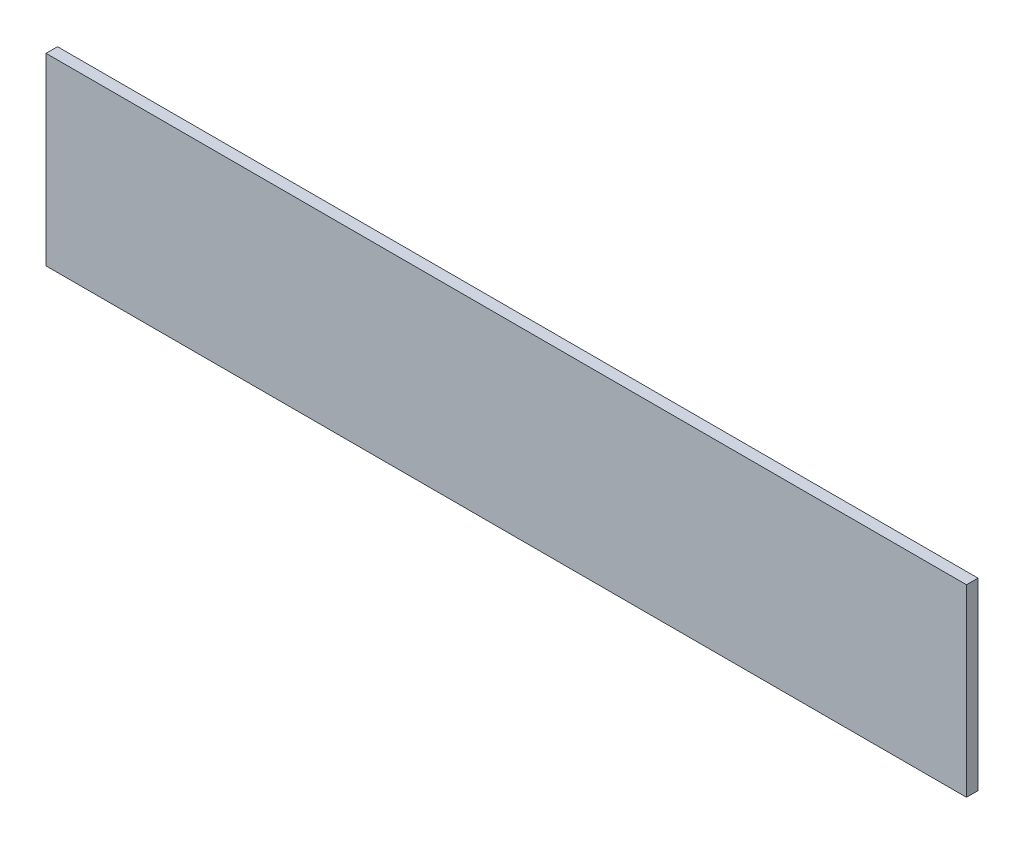
ISO-10303-21;
HEADER;
FILE_DESCRIPTION(('STEP AP214'),'2;1');
FILE_NAME('part.step','',(''),(''),'','','');
FILE_SCHEMA(('AUTOMOTIVE_DESIGN { 1 0 10303 214 1 1 1 1 }'));
ENDSEC;
DATA;
#1=APPLICATION_CONTEXT('core data for automotive mechanical design processes');
#2=APPLICATION_PROTOCOL_DEFINITION('international standard','automotive_design',2000,#1);
#3=PRODUCT_CONTEXT('',#1,'mechanical');
#4=PRODUCT('Part','Part','',(#3));
#5=PRODUCT_RELATED_PRODUCT_CATEGORY('part','',(#4));
#6=PRODUCT_DEFINITION_FORMATION('','',#4);
#7=PRODUCT_DEFINITION_CONTEXT('part definition',#1,'design');
#8=PRODUCT_DEFINITION('design','',#6,#7);
#9=PRODUCT_DEFINITION_SHAPE('','',#8);
#10=(LENGTH_UNIT() NAMED_UNIT(*) SI_UNIT(.MILLI.,.METRE.));
#11=(NAMED_UNIT(*) PLANE_ANGLE_UNIT() SI_UNIT($,.RADIAN.));
#12=(NAMED_UNIT(*) SI_UNIT($,.STERADIAN.) SOLID_ANGLE_UNIT());
#13=UNCERTAINTY_MEASURE_WITH_UNIT(LENGTH_MEASURE(1.E-05),#10,'distance_accuracy_value','');
#14=(GEOMETRIC_REPRESENTATION_CONTEXT(3) GLOBAL_UNCERTAINTY_ASSIGNED_CONTEXT((#13)) GLOBAL_UNIT_ASSIGNED_CONTEXT((#10,
#11,#12)) REPRESENTATION_CONTEXT('',''));
#15=CARTESIAN_POINT('',(0.,0.,0.));
#16=DIRECTION('',(0.,0.,1.));
#17=DIRECTION('',(1.,0.,0.));
#18=AXIS2_PLACEMENT_3D('',#15,#16,#17);
#19=CARTESIAN_POINT('',(127.,-25.4,1.5875));
#20=DIRECTION('',(-1.,0.,0.));
#21=DIRECTION('',(0.,0.,1.));
#22=AXIS2_PLACEMENT_3D('',#19,#20,#21);
#23=PLANE('',#22);
#24=DIRECTION('',(0.,1.,0.));
#25=VECTOR('',#24,1.);
#26=CARTESIAN_POINT('',(127.,-25.4,-1.5875));
#27=LINE('',#26,#25);
#28=CARTESIAN_POINT('',(127.,-25.4,-1.5875));
#29=VERTEX_POINT('',#28);
#30=CARTESIAN_POINT('',(127.,25.4,-1.5875));
#31=VERTEX_POINT('',#30);
#32=EDGE_CURVE('E107',#29,#31,#27,.T.);
#33=ORIENTED_EDGE('',*,*,#32,.T.);
#34=DIRECTION('',(0.,0.,-1.));
#35=VECTOR('',#34,1.);
#36=CARTESIAN_POINT('',(127.,25.4,1.5875));
#37=LINE('',#36,#35);
#38=CARTESIAN_POINT('',(127.,25.4,1.5875));
#39=VERTEX_POINT('',#38);
#40=EDGE_CURVE('E11',#39,#31,#37,.T.);
#41=ORIENTED_EDGE('',*,*,#40,.F.);
#42=DIRECTION('',(0.,1.,0.));
#43=VECTOR('',#42,1.);
#44=CARTESIAN_POINT('',(127.,-25.4,1.5875));
#45=LINE('',#44,#43);
#46=CARTESIAN_POINT('',(127.,-25.4,1.5875));
#47=VERTEX_POINT('',#46);
#48=EDGE_CURVE('E91',#47,#39,#45,.T.);
#49=ORIENTED_EDGE('',*,*,#48,.F.);
#50=DIRECTION('',(0.,0.,-1.));
#51=VECTOR('',#50,1.);
#52=CARTESIAN_POINT('',(127.,-25.4,1.5875));
#53=LINE('',#52,#51);
#54=EDGE_CURVE('E103',#47,#29,#53,.T.);
#55=ORIENTED_EDGE('',*,*,#54,.T.);
#56=EDGE_LOOP('',(#33,#41,#49,#55));
#57=FACE_BOUND('',#56,.T.);
#58=ADVANCED_FACE('F39',(#57),#23,.F.);
#59=CARTESIAN_POINT('',(-127.,25.4,1.5875));
#60=DIRECTION('',(0.,-1.,0.));
#61=DIRECTION('',(0.,0.,-1.));
#62=AXIS2_PLACEMENT_3D('',#59,#60,#61);
#63=PLANE('',#62);
#64=DIRECTION('',(-1.,0.,0.));
#65=VECTOR('',#64,1.);
#66=CARTESIAN_POINT('',(-127.,25.4,-1.5875));
#67=LINE('',#66,#65);
#68=CARTESIAN_POINT('',(-127.,25.4,-1.5875));
#69=VERTEX_POINT('',#68);
#70=EDGE_CURVE('E96',#31,#69,#67,.T.);
#71=ORIENTED_EDGE('',*,*,#70,.T.);
#72=DIRECTION('',(0.,0.,-1.));
#73=VECTOR('',#72,1.);
#74=CARTESIAN_POINT('',(-127.,25.4,1.5875));
#75=LINE('',#74,#73);
#76=CARTESIAN_POINT('',(-127.,25.4,1.5875));
#77=VERTEX_POINT('',#76);
#78=EDGE_CURVE('E48',#77,#69,#75,.T.);
#79=ORIENTED_EDGE('',*,*,#78,.F.);
#80=DIRECTION('',(-1.,0.,0.));
#81=VECTOR('',#80,1.);
#82=CARTESIAN_POINT('',(-127.,25.4,1.5875));
#83=LINE('',#82,#81);
#84=EDGE_CURVE('E86',#39,#77,#83,.T.);
#85=ORIENTED_EDGE('',*,*,#84,.F.);
#86=ORIENTED_EDGE('',*,*,#40,.T.);
#87=EDGE_LOOP('',(#71,#79,#85,#86));
#88=FACE_BOUND('',#87,.T.);
#89=ADVANCED_FACE('F95',(#88),#63,.F.);
#90=CARTESIAN_POINT('',(-127.,-25.4,1.5875));
#91=DIRECTION('',(1.,0.,0.));
#92=DIRECTION('',(0.,0.,-1.));
#93=AXIS2_PLACEMENT_3D('',#90,#91,#92);
#94=PLANE('',#93);
#95=DIRECTION('',(0.,-1.,0.));
#96=VECTOR('',#95,1.);
#97=CARTESIAN_POINT('',(-127.,-25.4,-1.5875));
#98=LINE('',#97,#96);
#99=CARTESIAN_POINT('',(-127.,-25.4,-1.5875));
#100=VERTEX_POINT('',#99);
#101=EDGE_CURVE('E73',#69,#100,#98,.T.);
#102=ORIENTED_EDGE('',*,*,#101,.T.);
#103=DIRECTION('',(0.,0.,-1.));
#104=VECTOR('',#103,1.);
#105=CARTESIAN_POINT('',(-127.,-25.4,1.5875));
#106=LINE('',#105,#104);
#107=CARTESIAN_POINT('',(-127.,-25.4,1.5875));
#108=VERTEX_POINT('',#107);
#109=EDGE_CURVE('E98',#108,#100,#106,.T.);
#110=ORIENTED_EDGE('',*,*,#109,.F.);
#111=DIRECTION('',(0.,-1.,0.));
#112=VECTOR('',#111,1.);
#113=CARTESIAN_POINT('',(-127.,-25.4,1.5875));
#114=LINE('',#113,#112);
#115=EDGE_CURVE('E89',#77,#108,#114,.T.);
#116=ORIENTED_EDGE('',*,*,#115,.F.);
#117=ORIENTED_EDGE('',*,*,#78,.T.);
#118=EDGE_LOOP('',(#102,#110,#116,#117));
#119=FACE_BOUND('',#118,.T.);
#120=ADVANCED_FACE('F99',(#119),#94,.F.);
#121=CARTESIAN_POINT('',(-127.,-25.4,1.5875));
#122=DIRECTION('',(0.,1.,0.));
#123=DIRECTION('',(0.,0.,1.));
#124=AXIS2_PLACEMENT_3D('',#121,#122,#123);
#125=PLANE('',#124);
#126=DIRECTION('',(1.,0.,0.));
#127=VECTOR('',#126,1.);
#128=CARTESIAN_POINT('',(-127.,-25.4,-1.5875));
#129=LINE('',#128,#127);
#130=EDGE_CURVE('E79',#100,#29,#129,.T.);
#131=ORIENTED_EDGE('',*,*,#130,.T.);
#132=ORIENTED_EDGE('',*,*,#54,.F.);
#133=DIRECTION('',(1.,0.,0.));
#134=VECTOR('',#133,1.);
#135=CARTESIAN_POINT('',(-127.,-25.4,1.5875));
#136=LINE('',#135,#134);
#137=EDGE_CURVE('E56',#108,#47,#136,.T.);
#138=ORIENTED_EDGE('',*,*,#137,.F.);
#139=ORIENTED_EDGE('',*,*,#109,.T.);
#140=EDGE_LOOP('',(#131,#132,#138,#139));
#141=FACE_BOUND('',#140,.T.);
#142=ADVANCED_FACE('F120',(#141),#125,.F.);
#143=CARTESIAN_POINT('',(0.,0.,1.5875));
#144=DIRECTION('',(0.,0.,-1.));
#145=DIRECTION('',(-1.,0.,0.));
#146=AXIS2_PLACEMENT_3D('',#143,#144,#145);
#147=PLANE('',#146);
#148=ORIENTED_EDGE('',*,*,#48,.T.);
#149=ORIENTED_EDGE('',*,*,#84,.T.);
#150=ORIENTED_EDGE('',*,*,#115,.T.);
#151=ORIENTED_EDGE('',*,*,#137,.T.);
#152=EDGE_LOOP('',(#148,#149,#150,#151));
#153=FACE_BOUND('',#152,.T.);
#154=ADVANCED_FACE('F87',(#153),#147,.F.);
#155=CARTESIAN_POINT('',(0.,0.,-1.5875));
#156=DIRECTION('',(0.,0.,-1.));
#157=DIRECTION('',(-1.,0.,0.));
#158=AXIS2_PLACEMENT_3D('',#155,#156,#157);
#159=PLANE('',#158);
#160=ORIENTED_EDGE('',*,*,#32,.F.);
#161=ORIENTED_EDGE('',*,*,#130,.F.);
#162=ORIENTED_EDGE('',*,*,#101,.F.);
#163=ORIENTED_EDGE('',*,*,#70,.F.);
#164=EDGE_LOOP('',(#160,#161,#162,#163));
#165=FACE_BOUND('',#164,.T.);
#166=ADVANCED_FACE('F123',(#165),#159,.T.);
#167=CLOSED_SHELL('',(#58,#89,#120,#142,#154,#166));
#168=MANIFOLD_SOLID_BREP('B2',#167);
#169=ADVANCED_BREP_SHAPE_REPRESENTATION('',(#18,#168),#14);
#170=SHAPE_DEFINITION_REPRESENTATION(#9,#169);
ENDSEC;
END-ISO-10303-21;
